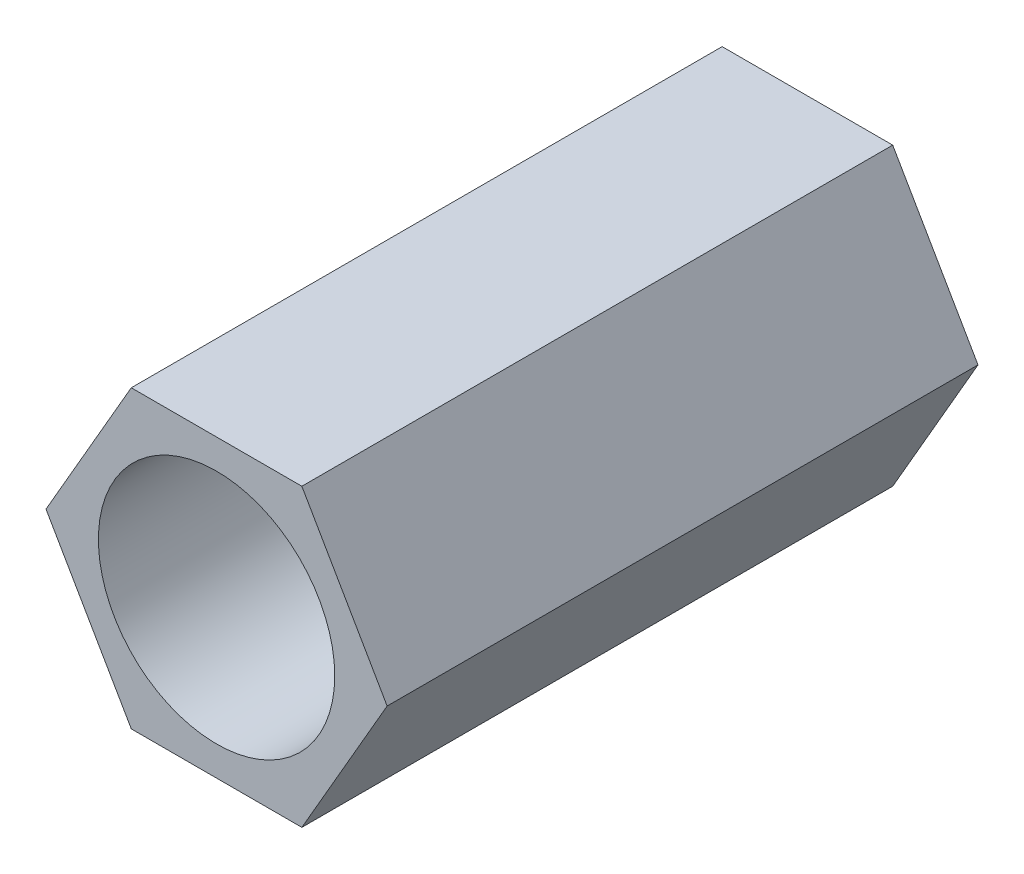
ISO-10303-21;
HEADER;
FILE_DESCRIPTION(('STEP AP214'),'2;1');
FILE_NAME('part.step','',(''),(''),'','','');
FILE_SCHEMA(('AUTOMOTIVE_DESIGN { 1 0 10303 214 1 1 1 1 }'));
ENDSEC;
DATA;
#1=APPLICATION_CONTEXT('core data for automotive mechanical design processes');
#2=APPLICATION_PROTOCOL_DEFINITION('international standard','automotive_design',2000,#1);
#3=PRODUCT_CONTEXT('',#1,'mechanical');
#4=PRODUCT('Part','Part','',(#3));
#5=PRODUCT_RELATED_PRODUCT_CATEGORY('part','',(#4));
#6=PRODUCT_DEFINITION_FORMATION('','',#4);
#7=PRODUCT_DEFINITION_CONTEXT('part definition',#1,'design');
#8=PRODUCT_DEFINITION('design','',#6,#7);
#9=PRODUCT_DEFINITION_SHAPE('','',#8);
#10=(LENGTH_UNIT() NAMED_UNIT(*) SI_UNIT(.MILLI.,.METRE.));
#11=(NAMED_UNIT(*) PLANE_ANGLE_UNIT() SI_UNIT($,.RADIAN.));
#12=(NAMED_UNIT(*) SI_UNIT($,.STERADIAN.) SOLID_ANGLE_UNIT());
#13=UNCERTAINTY_MEASURE_WITH_UNIT(LENGTH_MEASURE(1.E-05),#10,'distance_accuracy_value','');
#14=(GEOMETRIC_REPRESENTATION_CONTEXT(3) GLOBAL_UNCERTAINTY_ASSIGNED_CONTEXT((#13)) GLOBAL_UNIT_ASSIGNED_CONTEXT((#10,
#11,#12)) REPRESENTATION_CONTEXT('',''));
#15=CARTESIAN_POINT('',(0.,0.,0.));
#16=DIRECTION('',(0.,0.,1.));
#17=DIRECTION('',(1.,0.,0.));
#18=AXIS2_PLACEMENT_3D('',#15,#16,#17);
#19=CARTESIAN_POINT('',(2.88675134594818,-5.00000000000006,-20.));
#20=DIRECTION('',(-0.866025403784442,0.499999999999995,0.));
#21=DIRECTION('',(-0.499999999999995,-0.866025403784442,0.));
#22=AXIS2_PLACEMENT_3D('',#19,#20,#21);
#23=PLANE('',#22);
#24=DIRECTION('',(0.499999999999995,0.866025403784442,0.));
#25=VECTOR('',#24,1.);
#26=CARTESIAN_POINT('',(2.88675134594818,-5.00000000000006,0.));
#27=LINE('',#26,#25);
#28=CARTESIAN_POINT('',(2.88675134594818,-5.00000000000006,0.));
#29=VERTEX_POINT('',#28);
#30=CARTESIAN_POINT('',(5.77350269189625,-1.11022302462516E-13,0.));
#31=VERTEX_POINT('',#30);
#32=EDGE_CURVE('E116',#29,#31,#27,.T.);
#33=ORIENTED_EDGE('',*,*,#32,.F.);
#34=DIRECTION('',(0.,0.,1.));
#35=VECTOR('',#34,1.);
#36=CARTESIAN_POINT('',(2.88675134594818,-5.00000000000006,-20.));
#37=LINE('',#36,#35);
#38=CARTESIAN_POINT('',(2.88675134594818,-5.00000000000006,-20.));
#39=VERTEX_POINT('',#38);
#40=EDGE_CURVE('E115',#39,#29,#37,.T.);
#41=ORIENTED_EDGE('',*,*,#40,.F.);
#42=DIRECTION('',(0.499999999999995,0.866025403784442,0.));
#43=VECTOR('',#42,1.);
#44=CARTESIAN_POINT('',(2.88675134594818,-5.00000000000006,-20.));
#45=LINE('',#44,#43);
#46=CARTESIAN_POINT('',(5.77350269189625,-1.11022302462516E-13,-20.));
#47=VERTEX_POINT('',#46);
#48=EDGE_CURVE('E129',#39,#47,#45,.T.);
#49=ORIENTED_EDGE('',*,*,#48,.T.);
#50=DIRECTION('',(0.,0.,1.));
#51=VECTOR('',#50,1.);
#52=CARTESIAN_POINT('',(5.77350269189625,-1.11022302462516E-13,-20.));
#53=LINE('',#52,#51);
#54=EDGE_CURVE('E11',#47,#31,#53,.T.);
#55=ORIENTED_EDGE('',*,*,#54,.T.);
#56=EDGE_LOOP('',(#33,#41,#49,#55));
#57=FACE_BOUND('',#56,.T.);
#58=ADVANCED_FACE('F33',(#57),#23,.F.);
#59=CARTESIAN_POINT('',(5.77350269189625,-1.11022302462516E-13,-20.));
#60=DIRECTION('',(-0.866025403784438,-0.500000000000001,0.));
#61=DIRECTION('',(0.500000000000001,-0.866025403784438,0.));
#62=AXIS2_PLACEMENT_3D('',#59,#60,#61);
#63=PLANE('',#62);
#64=DIRECTION('',(-0.500000000000001,0.866025403784438,0.));
#65=VECTOR('',#64,1.);
#66=CARTESIAN_POINT('',(5.77350269189625,-1.11022302462516E-13,0.));
#67=LINE('',#66,#65);
#68=CARTESIAN_POINT('',(2.88675134594812,4.99999999999989,0.));
#69=VERTEX_POINT('',#68);
#70=EDGE_CURVE('E118',#31,#69,#67,.T.);
#71=ORIENTED_EDGE('',*,*,#70,.F.);
#72=ORIENTED_EDGE('',*,*,#54,.F.);
#73=DIRECTION('',(-0.500000000000001,0.866025403784438,0.));
#74=VECTOR('',#73,1.);
#75=CARTESIAN_POINT('',(5.77350269189625,-1.11022302462516E-13,-20.));
#76=LINE('',#75,#74);
#77=CARTESIAN_POINT('',(2.88675134594812,4.99999999999989,-20.));
#78=VERTEX_POINT('',#77);
#79=EDGE_CURVE('E81',#47,#78,#76,.T.);
#80=ORIENTED_EDGE('',*,*,#79,.T.);
#81=DIRECTION('',(0.,0.,1.));
#82=VECTOR('',#81,1.);
#83=CARTESIAN_POINT('',(2.88675134594812,4.99999999999989,-20.));
#84=LINE('',#83,#82);
#85=EDGE_CURVE('E41',#78,#69,#84,.T.);
#86=ORIENTED_EDGE('',*,*,#85,.T.);
#87=EDGE_LOOP('',(#71,#72,#80,#86));
#88=FACE_BOUND('',#87,.T.);
#89=ADVANCED_FACE('F135',(#88),#63,.F.);
#90=CARTESIAN_POINT('',(2.88675134594812,4.99999999999989,-20.));
#91=DIRECTION('',(0.,-1.,0.));
#92=DIRECTION('',(1.,0.,0.));
#93=AXIS2_PLACEMENT_3D('',#90,#91,#92);
#94=PLANE('',#93);
#95=DIRECTION('',(-1.,0.,0.));
#96=VECTOR('',#95,1.);
#97=CARTESIAN_POINT('',(2.88675134594812,4.99999999999989,0.));
#98=LINE('',#97,#96);
#99=CARTESIAN_POINT('',(-2.88675134594812,4.99999999999989,0.));
#100=VERTEX_POINT('',#99);
#101=EDGE_CURVE('E122',#69,#100,#98,.T.);
#102=ORIENTED_EDGE('',*,*,#101,.F.);
#103=ORIENTED_EDGE('',*,*,#85,.F.);
#104=DIRECTION('',(-1.,0.,0.));
#105=VECTOR('',#104,1.);
#106=CARTESIAN_POINT('',(2.88675134594812,4.99999999999989,-20.));
#107=LINE('',#106,#105);
#108=CARTESIAN_POINT('',(-2.88675134594812,4.99999999999989,-20.));
#109=VERTEX_POINT('',#108);
#110=EDGE_CURVE('E109',#78,#109,#107,.T.);
#111=ORIENTED_EDGE('',*,*,#110,.T.);
#112=DIRECTION('',(0.,0.,1.));
#113=VECTOR('',#112,1.);
#114=CARTESIAN_POINT('',(-2.88675134594812,4.99999999999989,-20.));
#115=LINE('',#114,#113);
#116=EDGE_CURVE('E103',#109,#100,#115,.T.);
#117=ORIENTED_EDGE('',*,*,#116,.T.);
#118=EDGE_LOOP('',(#102,#103,#111,#117));
#119=FACE_BOUND('',#118,.T.);
#120=ADVANCED_FACE('F168',(#119),#94,.F.);
#121=CARTESIAN_POINT('',(-2.88675134594812,4.99999999999989,-20.));
#122=DIRECTION('',(0.866025403784442,-0.499999999999995,0.));
#123=DIRECTION('',(0.499999999999995,0.866025403784442,0.));
#124=AXIS2_PLACEMENT_3D('',#121,#122,#123);
#125=PLANE('',#124);
#126=DIRECTION('',(-0.499999999999995,-0.866025403784441,0.));
#127=VECTOR('',#126,1.);
#128=CARTESIAN_POINT('',(-2.88675134594812,4.99999999999989,0.));
#129=LINE('',#128,#127);
#130=CARTESIAN_POINT('',(-5.77350269189622,-1.66533453693773E-13,0.));
#131=VERTEX_POINT('',#130);
#132=EDGE_CURVE('E125',#100,#131,#129,.T.);
#133=ORIENTED_EDGE('',*,*,#132,.F.);
#134=ORIENTED_EDGE('',*,*,#116,.F.);
#135=DIRECTION('',(-0.499999999999995,-0.866025403784441,0.));
#136=VECTOR('',#135,1.);
#137=CARTESIAN_POINT('',(-2.88675134594812,4.99999999999989,-20.));
#138=LINE('',#137,#136);
#139=CARTESIAN_POINT('',(-5.77350269189622,-1.66533453693773E-13,-20.));
#140=VERTEX_POINT('',#139);
#141=EDGE_CURVE('E93',#109,#140,#138,.T.);
#142=ORIENTED_EDGE('',*,*,#141,.T.);
#143=DIRECTION('',(0.,0.,1.));
#144=VECTOR('',#143,1.);
#145=CARTESIAN_POINT('',(-5.77350269189622,-1.66533453693773E-13,-20.));
#146=LINE('',#145,#144);
#147=EDGE_CURVE('E98',#140,#131,#146,.T.);
#148=ORIENTED_EDGE('',*,*,#147,.T.);
#149=EDGE_LOOP('',(#133,#134,#142,#148));
#150=FACE_BOUND('',#149,.T.);
#151=ADVANCED_FACE('F106',(#150),#125,.F.);
#152=CARTESIAN_POINT('',(-5.77350269189622,-1.66533453693773E-13,-20.));
#153=DIRECTION('',(0.866025403784434,0.500000000000007,0.));
#154=DIRECTION('',(-0.500000000000007,0.866025403784434,0.));
#155=AXIS2_PLACEMENT_3D('',#152,#153,#154);
#156=PLANE('',#155);
#157=DIRECTION('',(0.500000000000007,-0.866025403784434,0.));
#158=VECTOR('',#157,1.);
#159=CARTESIAN_POINT('',(-5.77350269189622,-1.66533453693773E-13,0.));
#160=LINE('',#159,#158);
#161=CARTESIAN_POINT('',(-2.88675134594807,-5.,0.));
#162=VERTEX_POINT('',#161);
#163=EDGE_CURVE('E100',#131,#162,#160,.T.);
#164=ORIENTED_EDGE('',*,*,#163,.F.);
#165=ORIENTED_EDGE('',*,*,#147,.F.);
#166=DIRECTION('',(0.500000000000007,-0.866025403784434,0.));
#167=VECTOR('',#166,1.);
#168=CARTESIAN_POINT('',(-5.77350269189622,-1.66533453693773E-13,-20.));
#169=LINE('',#168,#167);
#170=CARTESIAN_POINT('',(-2.88675134594807,-5.,-20.));
#171=VERTEX_POINT('',#170);
#172=EDGE_CURVE('E89',#140,#171,#169,.T.);
#173=ORIENTED_EDGE('',*,*,#172,.T.);
#174=DIRECTION('',(0.,0.,1.));
#175=VECTOR('',#174,1.);
#176=CARTESIAN_POINT('',(-2.88675134594807,-5.,-20.));
#177=LINE('',#176,#175);
#178=EDGE_CURVE('E104',#171,#162,#177,.T.);
#179=ORIENTED_EDGE('',*,*,#178,.T.);
#180=EDGE_LOOP('',(#164,#165,#173,#179));
#181=FACE_BOUND('',#180,.T.);
#182=ADVANCED_FACE('F99',(#181),#156,.F.);
#183=CARTESIAN_POINT('',(-2.88675134594807,-5.,-20.));
#184=DIRECTION('',(0.,1.,0.));
#185=DIRECTION('',(-1.,0.,0.));
#186=AXIS2_PLACEMENT_3D('',#183,#184,#185);
#187=PLANE('',#186);
#188=DIRECTION('',(1.,0.,0.));
#189=VECTOR('',#188,1.);
#190=CARTESIAN_POINT('',(-2.88675134594807,-5.,0.));
#191=LINE('',#190,#189);
#192=EDGE_CURVE('E69',#162,#29,#191,.T.);
#193=ORIENTED_EDGE('',*,*,#192,.F.);
#194=ORIENTED_EDGE('',*,*,#178,.F.);
#195=DIRECTION('',(1.,0.,0.));
#196=VECTOR('',#195,1.);
#197=CARTESIAN_POINT('',(-2.88675134594807,-5.,-20.));
#198=LINE('',#197,#196);
#199=EDGE_CURVE('E49',#171,#39,#198,.T.);
#200=ORIENTED_EDGE('',*,*,#199,.T.);
#201=ORIENTED_EDGE('',*,*,#40,.T.);
#202=EDGE_LOOP('',(#193,#194,#200,#201));
#203=FACE_BOUND('',#202,.T.);
#204=ADVANCED_FACE('F160',(#203),#187,.F.);
#205=CARTESIAN_POINT('',(0.,0.,-20.));
#206=DIRECTION('',(0.,0.,-1.));
#207=DIRECTION('',(1.,0.,0.));
#208=AXIS2_PLACEMENT_3D('',#205,#206,#207);
#209=PLANE('',#208);
#210=CARTESIAN_POINT('',(0.,0.,-20.));
#211=DIRECTION('',(0.,0.,1.));
#212=DIRECTION('',(1.,0.,0.));
#213=AXIS2_PLACEMENT_3D('',#210,#211,#212);
#214=CIRCLE('',#213,4.);
#215=CARTESIAN_POINT('',(4.,0.,-20.));
#216=VERTEX_POINT('',#215);
#217=EDGE_CURVE('E144',#216,#216,#214,.T.);
#218=ORIENTED_EDGE('',*,*,#217,.T.);
#219=EDGE_LOOP('',(#218));
#220=FACE_BOUND('',#219,.T.);
#221=ORIENTED_EDGE('',*,*,#48,.F.);
#222=ORIENTED_EDGE('',*,*,#199,.F.);
#223=ORIENTED_EDGE('',*,*,#172,.F.);
#224=ORIENTED_EDGE('',*,*,#141,.F.);
#225=ORIENTED_EDGE('',*,*,#110,.F.);
#226=ORIENTED_EDGE('',*,*,#79,.F.);
#227=EDGE_LOOP('',(#221,#222,#223,#224,#225,#226));
#228=FACE_BOUND('',#227,.T.);
#229=ADVANCED_FACE('F91',(#220,#228),#209,.T.);
#230=CARTESIAN_POINT('',(0.,0.,0.));
#231=DIRECTION('',(0.,0.,-1.));
#232=DIRECTION('',(1.,0.,0.));
#233=AXIS2_PLACEMENT_3D('',#230,#231,#232);
#234=PLANE('',#233);
#235=CARTESIAN_POINT('',(0.,0.,0.));
#236=DIRECTION('',(0.,0.,1.));
#237=DIRECTION('',(1.,0.,0.));
#238=AXIS2_PLACEMENT_3D('',#235,#236,#237);
#239=CIRCLE('',#238,4.);
#240=CARTESIAN_POINT('',(4.,0.,0.));
#241=VERTEX_POINT('',#240);
#242=EDGE_CURVE('E119',#241,#241,#239,.T.);
#243=ORIENTED_EDGE('',*,*,#242,.F.);
#244=EDGE_LOOP('',(#243));
#245=FACE_BOUND('',#244,.T.);
#246=ORIENTED_EDGE('',*,*,#32,.T.);
#247=ORIENTED_EDGE('',*,*,#70,.T.);
#248=ORIENTED_EDGE('',*,*,#101,.T.);
#249=ORIENTED_EDGE('',*,*,#132,.T.);
#250=ORIENTED_EDGE('',*,*,#163,.T.);
#251=ORIENTED_EDGE('',*,*,#192,.T.);
#252=EDGE_LOOP('',(#246,#247,#248,#249,#250,#251));
#253=FACE_BOUND('',#252,.T.);
#254=ADVANCED_FACE('F137',(#245,#253),#234,.F.);
#255=CARTESIAN_POINT('',(0.,0.,0.));
#256=DIRECTION('',(0.,0.,-1.));
#257=DIRECTION('',(1.,0.,0.));
#258=AXIS2_PLACEMENT_3D('',#255,#256,#257);
#259=CYLINDRICAL_SURFACE('',#258,4.);
#260=CARTESIAN_POINT('',(4.,0.,0.));
#261=CARTESIAN_POINT('',(4.,0.,-0.208333333333334));
#262=CARTESIAN_POINT('',(4.,0.,-0.416666666666667));
#263=CARTESIAN_POINT('',(4.,0.,-0.833333333333334));
#264=CARTESIAN_POINT('',(4.,0.,-1.04166666666667));
#265=CARTESIAN_POINT('',(4.,0.,-1.45833333333333));
#266=CARTESIAN_POINT('',(4.,0.,-1.66666666666667));
#267=CARTESIAN_POINT('',(4.,0.,-2.08333333333334));
#268=CARTESIAN_POINT('',(4.,0.,-2.29166666666667));
#269=CARTESIAN_POINT('',(4.,0.,-2.70833333333334));
#270=CARTESIAN_POINT('',(4.,0.,-2.91666666666667));
#271=CARTESIAN_POINT('',(4.,0.,-3.33333333333334));
#272=CARTESIAN_POINT('',(4.,0.,-3.54166666666667));
#273=CARTESIAN_POINT('',(4.,0.,-3.95833333333334));
#274=CARTESIAN_POINT('',(4.,0.,-4.16666666666667));
#275=CARTESIAN_POINT('',(4.,0.,-4.58333333333334));
#276=CARTESIAN_POINT('',(4.,0.,-4.79166666666667));
#277=CARTESIAN_POINT('',(4.,0.,-5.20833333333334));
#278=CARTESIAN_POINT('',(4.,0.,-5.41666666666667));
#279=CARTESIAN_POINT('',(4.,0.,-5.83333333333334));
#280=CARTESIAN_POINT('',(4.,0.,-6.04166666666667));
#281=CARTESIAN_POINT('',(4.,0.,-6.45833333333334));
#282=CARTESIAN_POINT('',(4.,0.,-6.66666666666667));
#283=CARTESIAN_POINT('',(4.,0.,-7.08333333333334));
#284=CARTESIAN_POINT('',(4.,0.,-7.29166666666667));
#285=CARTESIAN_POINT('',(4.,0.,-7.70833333333334));
#286=CARTESIAN_POINT('',(4.,0.,-7.91666666666668));
#287=CARTESIAN_POINT('',(4.,0.,-8.33333333333334));
#288=CARTESIAN_POINT('',(4.,0.,-8.54166666666668));
#289=CARTESIAN_POINT('',(4.,0.,-8.95833333333334));
#290=CARTESIAN_POINT('',(4.,0.,-9.16666666666668));
#291=CARTESIAN_POINT('',(4.,0.,-9.58333333333334));
#292=CARTESIAN_POINT('',(4.,0.,-9.79166666666668));
#293=CARTESIAN_POINT('',(4.,0.,-10.2083333333333));
#294=CARTESIAN_POINT('',(4.,0.,-10.4166666666667));
#295=CARTESIAN_POINT('',(4.,0.,-10.8333333333333));
#296=CARTESIAN_POINT('',(4.,0.,-11.0416666666667));
#297=CARTESIAN_POINT('',(4.,0.,-11.4583333333333));
#298=CARTESIAN_POINT('',(4.,0.,-11.6666666666667));
#299=CARTESIAN_POINT('',(4.,0.,-12.0833333333333));
#300=CARTESIAN_POINT('',(4.,0.,-12.2916666666667));
#301=CARTESIAN_POINT('',(4.,0.,-12.7083333333333));
#302=CARTESIAN_POINT('',(4.,0.,-12.9166666666667));
#303=CARTESIAN_POINT('',(4.,0.,-13.3333333333333));
#304=CARTESIAN_POINT('',(4.,0.,-13.5416666666667));
#305=CARTESIAN_POINT('',(4.,0.,-13.9583333333333));
#306=CARTESIAN_POINT('',(4.,0.,-14.1666666666667));
#307=CARTESIAN_POINT('',(4.,0.,-14.5833333333333));
#308=CARTESIAN_POINT('',(4.,0.,-14.7916666666667));
#309=CARTESIAN_POINT('',(4.,0.,-15.2083333333333));
#310=CARTESIAN_POINT('',(4.,0.,-15.4166666666667));
#311=CARTESIAN_POINT('',(4.,0.,-15.8333333333334));
#312=CARTESIAN_POINT('',(4.,0.,-16.0416666666667));
#313=CARTESIAN_POINT('',(4.,0.,-16.4583333333334));
#314=CARTESIAN_POINT('',(4.,0.,-16.6666666666667));
#315=CARTESIAN_POINT('',(4.,0.,-17.0833333333334));
#316=CARTESIAN_POINT('',(4.,0.,-17.2916666666667));
#317=CARTESIAN_POINT('',(4.,0.,-17.7083333333334));
#318=CARTESIAN_POINT('',(4.,0.,-17.9166666666667));
#319=CARTESIAN_POINT('',(4.,0.,-18.3333333333334));
#320=CARTESIAN_POINT('',(4.,0.,-18.5416666666667));
#321=CARTESIAN_POINT('',(4.,0.,-18.9583333333334));
#322=CARTESIAN_POINT('',(4.,0.,-19.1666666666667));
#323=CARTESIAN_POINT('',(4.,0.,-19.5833333333334));
#324=CARTESIAN_POINT('',(4.,0.,-19.7916666666667));
#325=CARTESIAN_POINT('',(4.,0.,-20.));
#326=B_SPLINE_CURVE_WITH_KNOTS('',3,(#260,#261,#262,#263,#264,#265,#266,#267,#268,#269,#270,
#271,#272,#273,#274,#275,#276,#277,#278,#279,#280,#281,#282,#283,#284,#285,#286,#287,#288,#289,
#290,#291,#292,#293,#294,#295,#296,#297,#298,#299,#300,#301,#302,#303,#304,#305,#306,#307,#308,
#309,#310,#311,#312,#313,#314,#315,#316,#317,#318,#319,#320,#321,#322,#323,#324,#325),
.UNSPECIFIED.,.F.,.F.,(4,2,2,2,2,2,2,2,2,2,2,2,2,2,2,2,2,2,2,2,2,2,2,2,2,2,2,2,2,2,2,2,4),(0.,
0.625000000000001,1.25,1.875,2.5,3.125,3.75,4.37500000000001,5.00000000000001,5.62500000000001,
6.25000000000001,6.87500000000001,7.50000000000001,8.12500000000001,8.75000000000001,
9.37500000000001,10.,10.625,11.25,11.875,12.5,13.125,13.75,14.375,15.,15.625,16.25,16.875,17.5,
18.125,18.75,19.375,20.),.UNSPECIFIED.);
#327=EDGE_CURVE('BSEAM150',#241,#216,#326,.T.);
#328=ORIENTED_EDGE('',*,*,#242,.T.);
#329=ORIENTED_EDGE('',*,*,#217,.F.);
#330=ORIENTED_EDGE('',*,*,#327,.T.);
#331=ORIENTED_EDGE('',*,*,#327,.F.);
#332=EDGE_LOOP('',(#328,#330,#329,#331));
#333=FACE_BOUND('',#332,.T.);
#334=ADVANCED_FACE('F150',(#333),#259,.F.);
#335=CLOSED_SHELL('',(#58,#89,#120,#151,#182,#204,#229,#254,#334));
#336=MANIFOLD_SOLID_BREP('B2',#335);
#337=ADVANCED_BREP_SHAPE_REPRESENTATION('',(#18,#336),#14);
#338=SHAPE_DEFINITION_REPRESENTATION(#9,#337);
ENDSEC;
END-ISO-10303-21;
